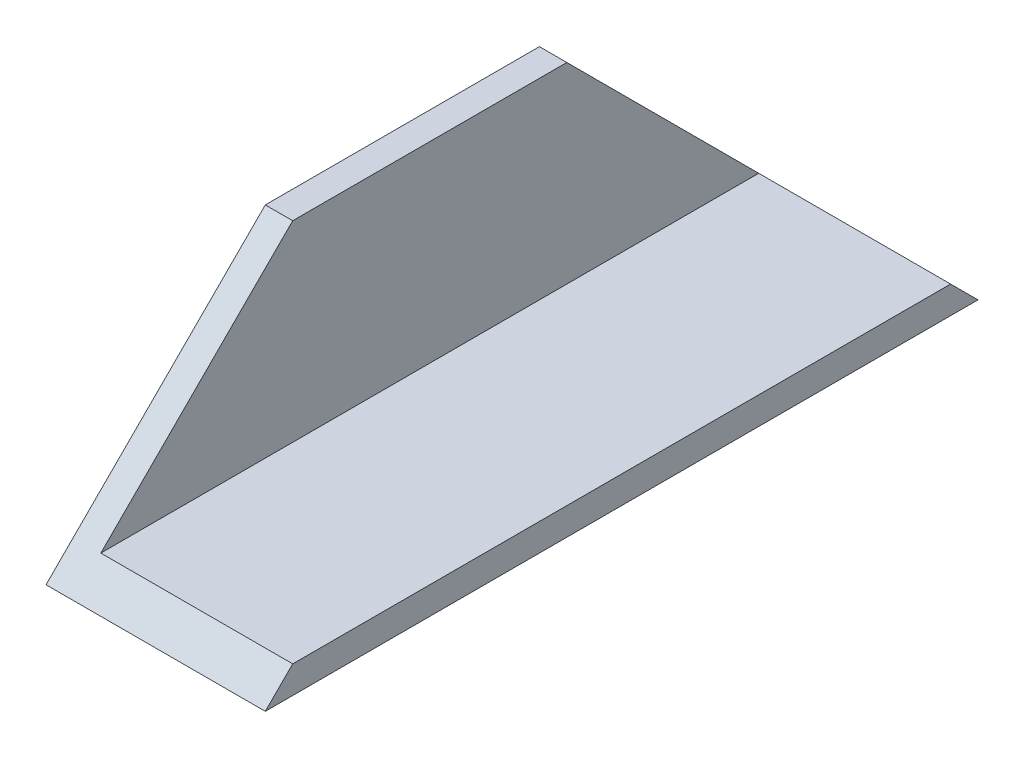
ISO-10303-21;
HEADER;
FILE_DESCRIPTION(('STEP AP214'),'2;1');
FILE_NAME('part.step','',(''),(''),'','','');
FILE_SCHEMA(('AUTOMOTIVE_DESIGN { 1 0 10303 214 1 1 1 1 }'));
ENDSEC;
DATA;
#1=APPLICATION_CONTEXT('core data for automotive mechanical design processes');
#2=APPLICATION_PROTOCOL_DEFINITION('international standard','automotive_design',2000,#1);
#3=PRODUCT_CONTEXT('',#1,'mechanical');
#4=PRODUCT('Part','Part','',(#3));
#5=PRODUCT_RELATED_PRODUCT_CATEGORY('part','',(#4));
#6=PRODUCT_DEFINITION_FORMATION('','',#4);
#7=PRODUCT_DEFINITION_CONTEXT('part definition',#1,'design');
#8=PRODUCT_DEFINITION('design','',#6,#7);
#9=PRODUCT_DEFINITION_SHAPE('','',#8);
#10=(LENGTH_UNIT() NAMED_UNIT(*) SI_UNIT(.MILLI.,.METRE.));
#11=(NAMED_UNIT(*) PLANE_ANGLE_UNIT() SI_UNIT($,.RADIAN.));
#12=(NAMED_UNIT(*) SI_UNIT($,.STERADIAN.) SOLID_ANGLE_UNIT());
#13=UNCERTAINTY_MEASURE_WITH_UNIT(LENGTH_MEASURE(1.E-05),#10,'distance_accuracy_value','');
#14=(GEOMETRIC_REPRESENTATION_CONTEXT(3) GLOBAL_UNCERTAINTY_ASSIGNED_CONTEXT((#13)) GLOBAL_UNIT_ASSIGNED_CONTEXT((#10,
#11,#12)) REPRESENTATION_CONTEXT('',''));
#15=CARTESIAN_POINT('',(0.,0.,0.));
#16=DIRECTION('',(0.,0.,1.));
#17=DIRECTION('',(1.,0.,0.));
#18=AXIS2_PLACEMENT_3D('',#15,#16,#17);
#19=CARTESIAN_POINT('',(-23.5857142857143,4.9892857142857,0.));
#20=DIRECTION('',(0.,1.,0.));
#21=DIRECTION('',(0.,0.,1.));
#22=AXIS2_PLACEMENT_3D('',#19,#20,#21);
#23=PLANE('',#22);
#24=DIRECTION('',(1.,0.,0.));
#25=VECTOR('',#24,1.);
#26=CARTESIAN_POINT('',(-22.8415736607143,4.98928571428568,3.17499999999998));
#27=LINE('',#26,#25);
#28=CARTESIAN_POINT('',(-23.5857142857143,4.9892857142857,3.17499999999997));
#29=VERTEX_POINT('',#28);
#30=CARTESIAN_POINT('',(-1.36071428571429,4.98928571428569,3.17499999999998));
#31=VERTEX_POINT('',#30);
#32=EDGE_CURVE('E83',#29,#31,#27,.T.);
#33=ORIENTED_EDGE('',*,*,#32,.F.);
#34=DIRECTION('',(0.,0.,-1.));
#35=VECTOR('',#34,1.);
#36=CARTESIAN_POINT('',(-23.5857142857143,4.9892857142857,0.));
#37=LINE('',#36,#35);
#38=CARTESIAN_POINT('',(-23.5857142857143,4.9892857142857,79.375));
#39=VERTEX_POINT('',#38);
#40=EDGE_CURVE('E20',#39,#29,#37,.T.);
#41=ORIENTED_EDGE('',*,*,#40,.F.);
#42=DIRECTION('',(1.,0.,0.));
#43=VECTOR('',#42,1.);
#44=CARTESIAN_POINT('',(-22.8415736607143,4.9892857142857,79.375));
#45=LINE('',#44,#43);
#46=CARTESIAN_POINT('',(-1.36071428571429,4.9892857142857,79.375));
#47=VERTEX_POINT('',#46);
#48=EDGE_CURVE('E100',#47,#39,#45,.F.);
#49=ORIENTED_EDGE('',*,*,#48,.F.);
#50=DIRECTION('',(0.,0.,-1.));
#51=VECTOR('',#50,1.);
#52=CARTESIAN_POINT('',(-1.3607142857143,4.9892857142857,0.));
#53=LINE('',#52,#51);
#54=EDGE_CURVE('E95',#31,#47,#53,.F.);
#55=ORIENTED_EDGE('',*,*,#54,.F.);
#56=EDGE_LOOP('',(#33,#41,#49,#55));
#57=FACE_BOUND('',#56,.T.);
#58=ADVANCED_FACE('F17',(#57),#23,.T.);
#59=CARTESIAN_POINT('',(-23.5857142857143,27.2142857142857,0.));
#60=DIRECTION('',(1.,0.,0.));
#61=DIRECTION('',(0.,0.,-1.));
#62=AXIS2_PLACEMENT_3D('',#59,#60,#61);
#63=PLANE('',#62);
#64=DIRECTION('',(0.,0.707106781186548,0.707106781186548));
#65=VECTOR('',#64,1.);
#66=CARTESIAN_POINT('',(-23.5857142857143,14.5142857142857,12.7));
#67=LINE('',#66,#65);
#68=CARTESIAN_POINT('',(-23.5857142857143,27.2142857142857,25.4));
#69=VERTEX_POINT('',#68);
#70=EDGE_CURVE('E80',#69,#29,#67,.F.);
#71=ORIENTED_EDGE('',*,*,#70,.F.);
#72=DIRECTION('',(0.,0.,1.));
#73=VECTOR('',#72,1.);
#74=CARTESIAN_POINT('',(-23.5857142857143,27.2142857142857,0.));
#75=LINE('',#74,#73);
#76=CARTESIAN_POINT('',(-23.5857142857143,27.2142857142857,57.15));
#77=VERTEX_POINT('',#76);
#78=EDGE_CURVE('E71',#77,#69,#75,.F.);
#79=ORIENTED_EDGE('',*,*,#78,.F.);
#80=DIRECTION('',(0.,-0.707106781186548,0.707106781186548));
#81=VECTOR('',#80,1.);
#82=CARTESIAN_POINT('',(-23.5857142857143,14.5142857142857,69.85));
#83=LINE('',#82,#81);
#84=EDGE_CURVE('E103',#39,#77,#83,.F.);
#85=ORIENTED_EDGE('',*,*,#84,.F.);
#86=ORIENTED_EDGE('',*,*,#40,.T.);
#87=EDGE_LOOP('',(#71,#79,#85,#86));
#88=FACE_BOUND('',#87,.T.);
#89=ADVANCED_FACE('F81',(#88),#63,.T.);
#90=CARTESIAN_POINT('',(-26.7607142857143,27.2142857142857,0.));
#91=DIRECTION('',(0.,1.,0.));
#92=DIRECTION('',(0.,0.,1.));
#93=AXIS2_PLACEMENT_3D('',#90,#91,#92);
#94=PLANE('',#93);
#95=DIRECTION('',(1.,0.,0.));
#96=VECTOR('',#95,1.);
#97=CARTESIAN_POINT('',(-22.8415736607143,27.2142857142857,25.4));
#98=LINE('',#97,#96);
#99=CARTESIAN_POINT('',(-26.7607142857143,27.2142857142857,25.4));
#100=VERTEX_POINT('',#99);
#101=EDGE_CURVE('E75',#100,#69,#98,.T.);
#102=ORIENTED_EDGE('',*,*,#101,.F.);
#103=DIRECTION('',(0.,0.,1.));
#104=VECTOR('',#103,1.);
#105=CARTESIAN_POINT('',(-26.7607142857143,27.2142857142857,0.));
#106=LINE('',#105,#104);
#107=CARTESIAN_POINT('',(-26.7607142857143,27.2142857142857,57.15));
#108=VERTEX_POINT('',#107);
#109=EDGE_CURVE('E107',#108,#100,#106,.F.);
#110=ORIENTED_EDGE('',*,*,#109,.F.);
#111=DIRECTION('',(1.,0.,0.));
#112=VECTOR('',#111,1.);
#113=CARTESIAN_POINT('',(-22.8415736607143,27.2142857142857,57.15));
#114=LINE('',#113,#112);
#115=EDGE_CURVE('E77',#77,#108,#114,.F.);
#116=ORIENTED_EDGE('',*,*,#115,.F.);
#117=ORIENTED_EDGE('',*,*,#78,.T.);
#118=EDGE_LOOP('',(#102,#110,#116,#117));
#119=FACE_BOUND('',#118,.T.);
#120=ADVANCED_FACE('F72',(#119),#94,.T.);
#121=CARTESIAN_POINT('',(-22.8415736607143,14.5142857142857,12.7));
#122=DIRECTION('',(0.,0.707106781186548,-0.707106781186548));
#123=DIRECTION('',(0.,0.707106781186548,0.707106781186548));
#124=AXIS2_PLACEMENT_3D('',#121,#122,#123);
#125=PLANE('',#124);
#126=ORIENTED_EDGE('',*,*,#70,.T.);
#127=ORIENTED_EDGE('',*,*,#32,.T.);
#128=DIRECTION('',(0.,0.707106781186548,0.707106781186547));
#129=VECTOR('',#128,1.);
#130=CARTESIAN_POINT('',(-1.3607142857143,1.81428571428571,0.));
#131=LINE('',#130,#129);
#132=CARTESIAN_POINT('',(-1.36071428571429,1.8142857142857,0.));
#133=VERTEX_POINT('',#132);
#134=EDGE_CURVE('E92',#133,#31,#131,.T.);
#135=ORIENTED_EDGE('',*,*,#134,.F.);
#136=DIRECTION('',(1.,0.,0.));
#137=VECTOR('',#136,1.);
#138=CARTESIAN_POINT('',(-1.3607142857143,1.8142857142857,0.));
#139=LINE('',#138,#137);
#140=CARTESIAN_POINT('',(-26.7607142857143,1.8142857142857,0.));
#141=VERTEX_POINT('',#140);
#142=EDGE_CURVE('E110',#141,#133,#139,.T.);
#143=ORIENTED_EDGE('',*,*,#142,.F.);
#144=DIRECTION('',(0.,-0.707106781186547,-0.707106781186548));
#145=VECTOR('',#144,1.);
#146=CARTESIAN_POINT('',(-26.7607142857143,27.2142857142857,25.4));
#147=LINE('',#146,#145);
#148=EDGE_CURVE('E87',#100,#141,#147,.T.);
#149=ORIENTED_EDGE('',*,*,#148,.F.);
#150=ORIENTED_EDGE('',*,*,#101,.T.);
#151=EDGE_LOOP('',(#126,#127,#135,#143,#149,#150));
#152=FACE_BOUND('',#151,.T.);
#153=ADVANCED_FACE('F85',(#152),#125,.T.);
#154=CARTESIAN_POINT('',(-1.3607142857143,4.9892857142857,0.));
#155=DIRECTION('',(1.,0.,0.));
#156=DIRECTION('',(0.,0.,-1.));
#157=AXIS2_PLACEMENT_3D('',#154,#155,#156);
#158=PLANE('',#157);
#159=ORIENTED_EDGE('',*,*,#134,.T.);
#160=ORIENTED_EDGE('',*,*,#54,.T.);
#161=DIRECTION('',(0.,-0.707106781186548,0.707106781186548));
#162=VECTOR('',#161,1.);
#163=CARTESIAN_POINT('',(-1.36071428571428,14.5142857142857,69.85));
#164=LINE('',#163,#162);
#165=CARTESIAN_POINT('',(-1.36071428571429,1.81428571428571,82.55));
#166=VERTEX_POINT('',#165);
#167=EDGE_CURVE('E97',#166,#47,#164,.F.);
#168=ORIENTED_EDGE('',*,*,#167,.F.);
#169=DIRECTION('',(0.,0.,-1.));
#170=VECTOR('',#169,1.);
#171=CARTESIAN_POINT('',(-1.36071428571429,1.8142857142857,0.));
#172=LINE('',#171,#170);
#173=EDGE_CURVE('E113',#133,#166,#172,.F.);
#174=ORIENTED_EDGE('',*,*,#173,.F.);
#175=EDGE_LOOP('',(#159,#160,#168,#174));
#176=FACE_BOUND('',#175,.T.);
#177=ADVANCED_FACE('F123',(#176),#158,.T.);
#178=CARTESIAN_POINT('',(-22.8415736607143,14.5142857142857,69.85));
#179=DIRECTION('',(0.,0.707106781186548,0.707106781186548));
#180=DIRECTION('',(0.,-0.707106781186548,0.707106781186548));
#181=AXIS2_PLACEMENT_3D('',#178,#179,#180);
#182=PLANE('',#181);
#183=DIRECTION('',(0.,0.707106781186547,-0.707106781186548));
#184=VECTOR('',#183,1.);
#185=CARTESIAN_POINT('',(-26.7607142857143,1.81428571428572,82.55));
#186=LINE('',#185,#184);
#187=CARTESIAN_POINT('',(-26.7607142857143,1.81428571428571,82.55));
#188=VERTEX_POINT('',#187);
#189=EDGE_CURVE('E35',#188,#108,#186,.T.);
#190=ORIENTED_EDGE('',*,*,#189,.F.);
#191=DIRECTION('',(1.,0.,0.));
#192=VECTOR('',#191,1.);
#193=CARTESIAN_POINT('',(-1.3607142857143,1.8142857142857,82.55));
#194=LINE('',#193,#192);
#195=EDGE_CURVE('E26',#166,#188,#194,.F.);
#196=ORIENTED_EDGE('',*,*,#195,.F.);
#197=ORIENTED_EDGE('',*,*,#167,.T.);
#198=ORIENTED_EDGE('',*,*,#48,.T.);
#199=ORIENTED_EDGE('',*,*,#84,.T.);
#200=ORIENTED_EDGE('',*,*,#115,.T.);
#201=EDGE_LOOP('',(#190,#196,#197,#198,#199,#200));
#202=FACE_BOUND('',#201,.T.);
#203=ADVANCED_FACE('F120',(#202),#182,.T.);
#204=CARTESIAN_POINT('',(-26.7607142857143,1.8142857142857,0.));
#205=DIRECTION('',(-1.,0.,0.));
#206=DIRECTION('',(0.,0.,1.));
#207=AXIS2_PLACEMENT_3D('',#204,#205,#206);
#208=PLANE('',#207);
#209=ORIENTED_EDGE('',*,*,#148,.T.);
#210=DIRECTION('',(0.,0.,-1.));
#211=VECTOR('',#210,1.);
#212=CARTESIAN_POINT('',(-26.7607142857143,1.8142857142857,0.));
#213=LINE('',#212,#211);
#214=EDGE_CURVE('E11',#188,#141,#213,.T.);
#215=ORIENTED_EDGE('',*,*,#214,.F.);
#216=ORIENTED_EDGE('',*,*,#189,.T.);
#217=ORIENTED_EDGE('',*,*,#109,.T.);
#218=EDGE_LOOP('',(#209,#215,#216,#217));
#219=FACE_BOUND('',#218,.T.);
#220=ADVANCED_FACE('F127',(#219),#208,.T.);
#221=CARTESIAN_POINT('',(-1.3607142857143,1.8142857142857,0.));
#222=DIRECTION('',(0.,-1.,0.));
#223=DIRECTION('',(0.,0.,-1.));
#224=AXIS2_PLACEMENT_3D('',#221,#222,#223);
#225=PLANE('',#224);
#226=ORIENTED_EDGE('',*,*,#195,.T.);
#227=ORIENTED_EDGE('',*,*,#214,.T.);
#228=ORIENTED_EDGE('',*,*,#142,.T.);
#229=ORIENTED_EDGE('',*,*,#173,.T.);
#230=EDGE_LOOP('',(#226,#227,#228,#229));
#231=FACE_BOUND('',#230,.T.);
#232=ADVANCED_FACE('F118',(#231),#225,.T.);
#233=CLOSED_SHELL('',(#58,#89,#120,#153,#177,#203,#220,#232));
#234=MANIFOLD_SOLID_BREP('B1',#233);
#235=ADVANCED_BREP_SHAPE_REPRESENTATION('',(#18,#234),#14);
#236=SHAPE_DEFINITION_REPRESENTATION(#9,#235);
ENDSEC;
END-ISO-10303-21;
